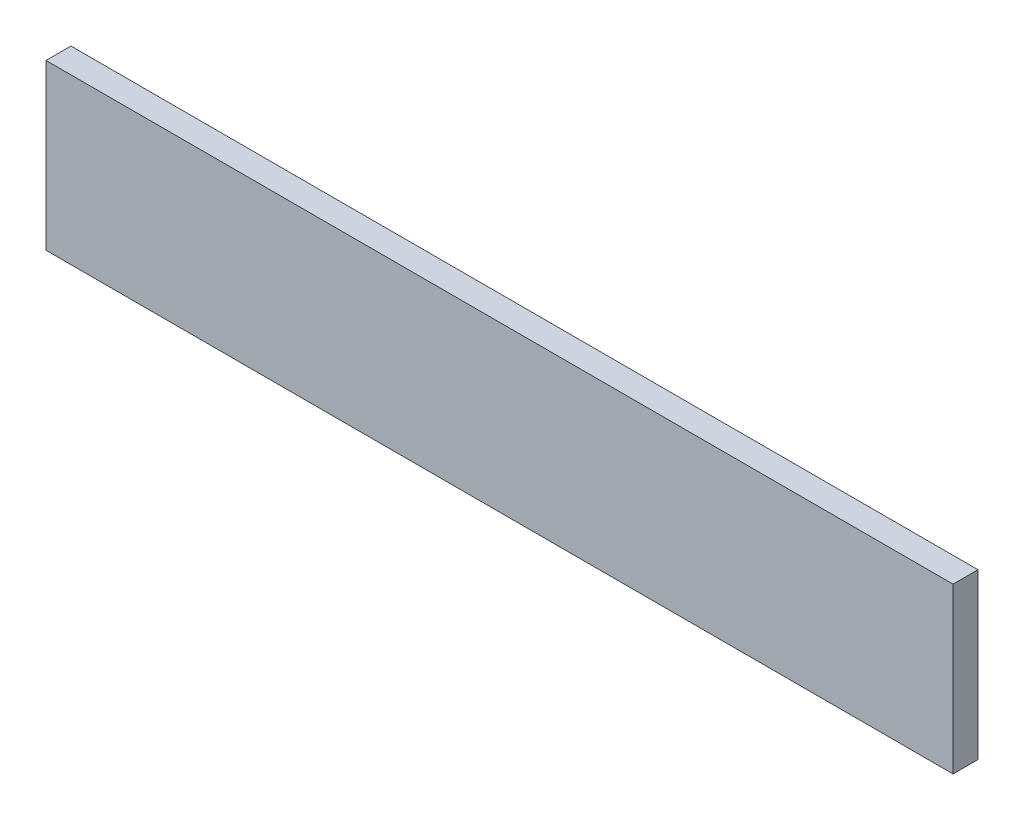
ISO-10303-21;
HEADER;
FILE_DESCRIPTION(('STEP AP214'),'2;1');
FILE_NAME('part.step','',(''),(''),'','','');
FILE_SCHEMA(('AUTOMOTIVE_DESIGN { 1 0 10303 214 1 1 1 1 }'));
ENDSEC;
DATA;
#1=APPLICATION_CONTEXT('core data for automotive mechanical design processes');
#2=APPLICATION_PROTOCOL_DEFINITION('international standard','automotive_design',2000,#1);
#3=PRODUCT_CONTEXT('',#1,'mechanical');
#4=PRODUCT('Part','Part','',(#3));
#5=PRODUCT_RELATED_PRODUCT_CATEGORY('part','',(#4));
#6=PRODUCT_DEFINITION_FORMATION('','',#4);
#7=PRODUCT_DEFINITION_CONTEXT('part definition',#1,'design');
#8=PRODUCT_DEFINITION('design','',#6,#7);
#9=PRODUCT_DEFINITION_SHAPE('','',#8);
#10=(LENGTH_UNIT() NAMED_UNIT(*) SI_UNIT(.MILLI.,.METRE.));
#11=(NAMED_UNIT(*) PLANE_ANGLE_UNIT() SI_UNIT($,.RADIAN.));
#12=(NAMED_UNIT(*) SI_UNIT($,.STERADIAN.) SOLID_ANGLE_UNIT());
#13=UNCERTAINTY_MEASURE_WITH_UNIT(LENGTH_MEASURE(1.E-05),#10,'distance_accuracy_value','');
#14=(GEOMETRIC_REPRESENTATION_CONTEXT(3) GLOBAL_UNCERTAINTY_ASSIGNED_CONTEXT((#13)) GLOBAL_UNIT_ASSIGNED_CONTEXT((#10,
#11,#12)) REPRESENTATION_CONTEXT('',''));
#15=CARTESIAN_POINT('',(0.,0.,0.));
#16=DIRECTION('',(0.,0.,1.));
#17=DIRECTION('',(1.,0.,0.));
#18=AXIS2_PLACEMENT_3D('',#15,#16,#17);
#19=CARTESIAN_POINT('',(400.,-145.,22.));
#20=DIRECTION('',(0.,1.,0.));
#21=DIRECTION('',(0.,0.,1.));
#22=AXIS2_PLACEMENT_3D('',#19,#20,#21);
#23=PLANE('',#22);
#24=DIRECTION('',(1.,0.,0.));
#25=VECTOR('',#24,1.);
#26=CARTESIAN_POINT('',(400.,-145.,0.));
#27=LINE('',#26,#25);
#28=CARTESIAN_POINT('',(-400.,-145.,0.));
#29=VERTEX_POINT('',#28);
#30=CARTESIAN_POINT('',(400.,-145.,0.));
#31=VERTEX_POINT('',#30);
#32=EDGE_CURVE('E90',#29,#31,#27,.T.);
#33=ORIENTED_EDGE('',*,*,#32,.T.);
#34=DIRECTION('',(0.,0.,-1.));
#35=VECTOR('',#34,1.);
#36=CARTESIAN_POINT('',(400.,-145.,22.));
#37=LINE('',#36,#35);
#38=CARTESIAN_POINT('',(400.,-145.,22.));
#39=VERTEX_POINT('',#38);
#40=EDGE_CURVE('E43',#39,#31,#37,.T.);
#41=ORIENTED_EDGE('',*,*,#40,.F.);
#42=DIRECTION('',(1.,0.,0.));
#43=VECTOR('',#42,1.);
#44=CARTESIAN_POINT('',(400.,-145.,22.));
#45=LINE('',#44,#43);
#46=CARTESIAN_POINT('',(-400.,-145.,22.));
#47=VERTEX_POINT('',#46);
#48=EDGE_CURVE('E79',#47,#39,#45,.T.);
#49=ORIENTED_EDGE('',*,*,#48,.F.);
#50=DIRECTION('',(0.,0.,-1.));
#51=VECTOR('',#50,1.);
#52=CARTESIAN_POINT('',(-400.,-145.,22.));
#53=LINE('',#52,#51);
#54=EDGE_CURVE('E11',#47,#29,#53,.T.);
#55=ORIENTED_EDGE('',*,*,#54,.T.);
#56=EDGE_LOOP('',(#33,#41,#49,#55));
#57=FACE_BOUND('',#56,.T.);
#58=ADVANCED_FACE('F35',(#57),#23,.F.);
#59=CARTESIAN_POINT('',(400.,-20.0000000000001,22.));
#60=DIRECTION('',(-1.,0.,0.));
#61=DIRECTION('',(0.,-1.,0.));
#62=AXIS2_PLACEMENT_3D('',#59,#60,#61);
#63=PLANE('',#62);
#64=DIRECTION('',(0.,1.,0.));
#65=VECTOR('',#64,1.);
#66=CARTESIAN_POINT('',(400.,-20.0000000000001,0.));
#67=LINE('',#66,#65);
#68=CARTESIAN_POINT('',(400.,0.,0.));
#69=VERTEX_POINT('',#68);
#70=EDGE_CURVE('E100',#31,#69,#67,.T.);
#71=ORIENTED_EDGE('',*,*,#70,.T.);
#72=DIRECTION('',(0.,0.,-1.));
#73=VECTOR('',#72,1.);
#74=CARTESIAN_POINT('',(400.,0.,22.));
#75=LINE('',#74,#73);
#76=CARTESIAN_POINT('',(400.,0.,22.));
#77=VERTEX_POINT('',#76);
#78=EDGE_CURVE('E92',#77,#69,#75,.T.);
#79=ORIENTED_EDGE('',*,*,#78,.F.);
#80=DIRECTION('',(0.,1.,0.));
#81=VECTOR('',#80,1.);
#82=CARTESIAN_POINT('',(400.,-20.0000000000001,22.));
#83=LINE('',#82,#81);
#84=EDGE_CURVE('E82',#39,#77,#83,.T.);
#85=ORIENTED_EDGE('',*,*,#84,.F.);
#86=ORIENTED_EDGE('',*,*,#40,.T.);
#87=EDGE_LOOP('',(#71,#79,#85,#86));
#88=FACE_BOUND('',#87,.T.);
#89=ADVANCED_FACE('F93',(#88),#63,.F.);
#90=CARTESIAN_POINT('',(-400.,-1.11022302462516E-13,22.));
#91=DIRECTION('',(0.,-1.,0.));
#92=DIRECTION('',(1.,0.,0.));
#93=AXIS2_PLACEMENT_3D('',#90,#91,#92);
#94=PLANE('',#93);
#95=DIRECTION('',(-1.,0.,0.));
#96=VECTOR('',#95,1.);
#97=CARTESIAN_POINT('',(-400.,-1.11022302462516E-13,0.));
#98=LINE('',#97,#96);
#99=CARTESIAN_POINT('',(-400.,-1.11022302462516E-13,0.));
#100=VERTEX_POINT('',#99);
#101=EDGE_CURVE('E67',#69,#100,#98,.T.);
#102=ORIENTED_EDGE('',*,*,#101,.T.);
#103=DIRECTION('',(0.,0.,-1.));
#104=VECTOR('',#103,1.);
#105=CARTESIAN_POINT('',(-400.,-1.11022302462516E-13,22.));
#106=LINE('',#105,#104);
#107=CARTESIAN_POINT('',(-400.,-1.11022302462516E-13,22.));
#108=VERTEX_POINT('',#107);
#109=EDGE_CURVE('E95',#108,#100,#106,.T.);
#110=ORIENTED_EDGE('',*,*,#109,.F.);
#111=DIRECTION('',(-1.,0.,0.));
#112=VECTOR('',#111,1.);
#113=CARTESIAN_POINT('',(400.,0.,22.));
#114=LINE('',#113,#112);
#115=EDGE_CURVE('E51',#77,#108,#114,.T.);
#116=ORIENTED_EDGE('',*,*,#115,.F.);
#117=ORIENTED_EDGE('',*,*,#78,.T.);
#118=EDGE_LOOP('',(#102,#110,#116,#117));
#119=FACE_BOUND('',#118,.T.);
#120=ADVANCED_FACE('F106',(#119),#94,.F.);
#121=CARTESIAN_POINT('',(-400.,-20.0000000000001,22.));
#122=DIRECTION('',(1.,0.,0.));
#123=DIRECTION('',(0.,0.,-1.));
#124=AXIS2_PLACEMENT_3D('',#121,#122,#123);
#125=PLANE('',#124);
#126=DIRECTION('',(0.,-1.,0.));
#127=VECTOR('',#126,1.);
#128=CARTESIAN_POINT('',(-400.,-20.0000000000001,0.));
#129=LINE('',#128,#127);
#130=EDGE_CURVE('E103',#100,#29,#129,.T.);
#131=ORIENTED_EDGE('',*,*,#130,.T.);
#132=ORIENTED_EDGE('',*,*,#54,.F.);
#133=DIRECTION('',(0.,-1.,0.));
#134=VECTOR('',#133,1.);
#135=CARTESIAN_POINT('',(-400.,-20.0000000000001,22.));
#136=LINE('',#135,#134);
#137=EDGE_CURVE('E84',#108,#47,#136,.T.);
#138=ORIENTED_EDGE('',*,*,#137,.F.);
#139=ORIENTED_EDGE('',*,*,#109,.T.);
#140=EDGE_LOOP('',(#131,#132,#138,#139));
#141=FACE_BOUND('',#140,.T.);
#142=ADVANCED_FACE('F108',(#141),#125,.F.);
#143=CARTESIAN_POINT('',(-400.,-145.,22.));
#144=DIRECTION('',(0.,0.,-1.));
#145=DIRECTION('',(-1.,0.,0.));
#146=AXIS2_PLACEMENT_3D('',#143,#144,#145);
#147=PLANE('',#146);
#148=ORIENTED_EDGE('',*,*,#137,.T.);
#149=ORIENTED_EDGE('',*,*,#48,.T.);
#150=ORIENTED_EDGE('',*,*,#84,.T.);
#151=ORIENTED_EDGE('',*,*,#115,.T.);
#152=EDGE_LOOP('',(#148,#149,#150,#151));
#153=FACE_BOUND('',#152,.T.);
#154=ADVANCED_FACE('F80',(#153),#147,.F.);
#155=CARTESIAN_POINT('',(-400.,-145.,0.));
#156=DIRECTION('',(0.,0.,-1.));
#157=DIRECTION('',(-1.,0.,0.));
#158=AXIS2_PLACEMENT_3D('',#155,#156,#157);
#159=PLANE('',#158);
#160=ORIENTED_EDGE('',*,*,#32,.F.);
#161=ORIENTED_EDGE('',*,*,#130,.F.);
#162=ORIENTED_EDGE('',*,*,#101,.F.);
#163=ORIENTED_EDGE('',*,*,#70,.F.);
#164=EDGE_LOOP('',(#160,#161,#162,#163));
#165=FACE_BOUND('',#164,.T.);
#166=ADVANCED_FACE('F109',(#165),#159,.T.);
#167=CLOSED_SHELL('',(#58,#89,#120,#142,#154,#166));
#168=MANIFOLD_SOLID_BREP('B2',#167);
#169=ADVANCED_BREP_SHAPE_REPRESENTATION('',(#18,#168),#14);
#170=SHAPE_DEFINITION_REPRESENTATION(#9,#169);
ENDSEC;
END-ISO-10303-21;
